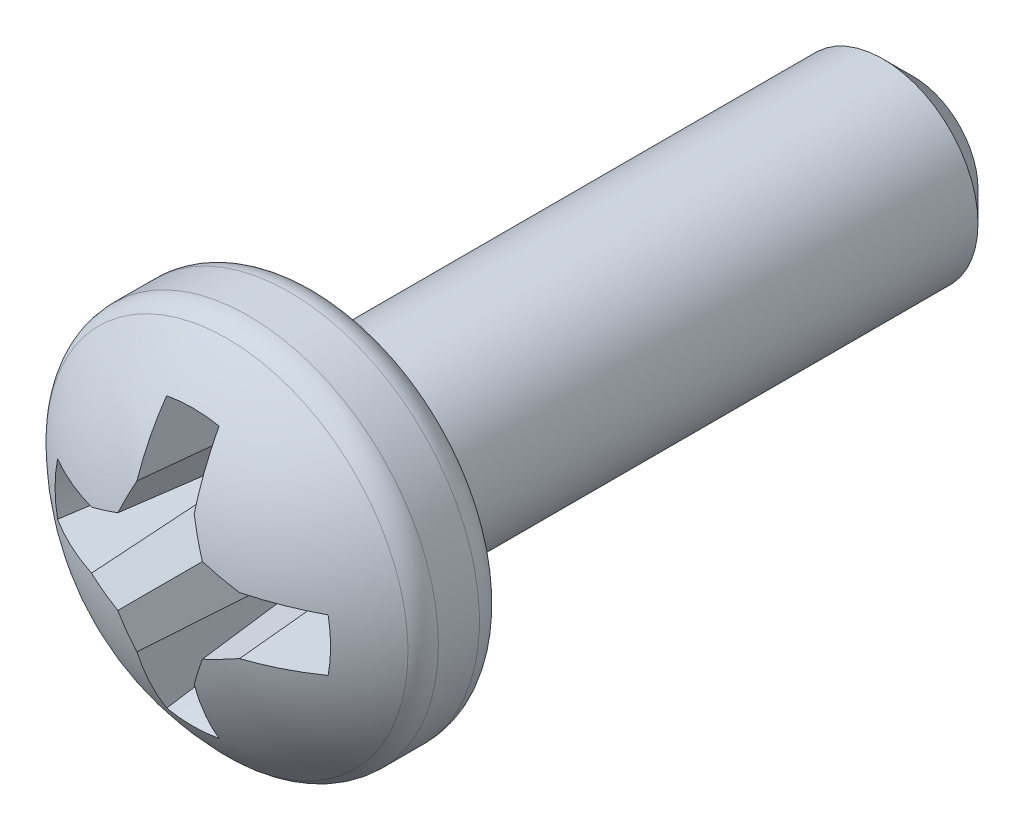
ISO-10303-21;
HEADER;
FILE_DESCRIPTION(('STEP AP214'),'2;1');
FILE_NAME('part.step','',(''),(''),'','','');
FILE_SCHEMA(('AUTOMOTIVE_DESIGN { 1 0 10303 214 1 1 1 1 }'));
ENDSEC;
DATA;
#1=APPLICATION_CONTEXT('core data for automotive mechanical design processes');
#2=APPLICATION_PROTOCOL_DEFINITION('international standard','automotive_design',2000,#1);
#3=PRODUCT_CONTEXT('',#1,'mechanical');
#4=PRODUCT('Part','Part','',(#3));
#5=PRODUCT_RELATED_PRODUCT_CATEGORY('part','',(#4));
#6=PRODUCT_DEFINITION_FORMATION('','',#4);
#7=PRODUCT_DEFINITION_CONTEXT('part definition',#1,'design');
#8=PRODUCT_DEFINITION('design','',#6,#7);
#9=PRODUCT_DEFINITION_SHAPE('','',#8);
#10=(LENGTH_UNIT() NAMED_UNIT(*) SI_UNIT(.MILLI.,.METRE.));
#11=(NAMED_UNIT(*) PLANE_ANGLE_UNIT() SI_UNIT($,.RADIAN.));
#12=(NAMED_UNIT(*) SI_UNIT($,.STERADIAN.) SOLID_ANGLE_UNIT());
#13=UNCERTAINTY_MEASURE_WITH_UNIT(LENGTH_MEASURE(1.E-05),#10,'distance_accuracy_value','');
#14=(GEOMETRIC_REPRESENTATION_CONTEXT(3) GLOBAL_UNCERTAINTY_ASSIGNED_CONTEXT((#13)) GLOBAL_UNIT_ASSIGNED_CONTEXT((#10,
#11,#12)) REPRESENTATION_CONTEXT('',''));
#15=CARTESIAN_POINT('',(0.,0.,0.));
#16=DIRECTION('',(0.,0.,1.));
#17=DIRECTION('',(1.,0.,0.));
#18=AXIS2_PLACEMENT_3D('',#15,#16,#17);
#19=CARTESIAN_POINT('',(0.905878325384203,0.791461441644268,0.413196607862429));
#20=DIRECTION('',(0.,0.,1.));
#21=DIRECTION('',(1.,0.,0.));
#22=AXIS2_PLACEMENT_3D('',#19,#20,#21);
#23=PLANE('',#22);
#24=DIRECTION('',(0.382683432365081,-0.92387953251129,0.));
#25=VECTOR('',#24,1.);
#26=CARTESIAN_POINT('',(0.919192212154071,0.796976234112247,0.413196607862429));
#27=LINE('',#26,#25);
#28=CARTESIAN_POINT('',(0.911621966738697,0.815252423264536,0.413196607862429));
#29=VERTEX_POINT('',#28);
#30=CARTESIAN_POINT('',(0.916907910320162,0.802491026580226,0.413196607862429));
#31=VERTEX_POINT('',#30);
#32=EDGE_CURVE('E292',#29,#31,#27,.T.);
#33=ORIENTED_EDGE('',*,*,#32,.F.);
#34=DIRECTION('',(0.,1.,0.));
#35=VECTOR('',#34,1.);
#36=CARTESIAN_POINT('',(0.911621966738698,0.791461441644268,0.413196607862429));
#37=LINE('',#36,#35);
#38=CARTESIAN_POINT('',(0.911621966738698,0.827667770299277,0.413196607862429));
#39=VERTEX_POINT('',#38);
#40=EDGE_CURVE('E168',#39,#29,#37,.F.);
#41=ORIENTED_EDGE('',*,*,#40,.F.);
#42=CARTESIAN_POINT('',(0.905878325384203,0.791461441644268,0.413196607862429));
#43=DIRECTION('',(0.,0.,1.));
#44=DIRECTION('',(1.,0.,0.));
#45=AXIS2_PLACEMENT_3D('',#42,#43,#44);
#46=CIRCLE('',#45,0.0366590732381981);
#47=CARTESIAN_POINT('',(0.900134684029712,0.827667770299278,0.413196607862429));
#48=VERTEX_POINT('',#47);
#49=EDGE_CURVE('E159',#39,#48,#46,.T.);
#50=ORIENTED_EDGE('',*,*,#49,.T.);
#51=DIRECTION('',(0.,1.,0.));
#52=VECTOR('',#51,1.);
#53=CARTESIAN_POINT('',(0.900134684029713,0.791461441644271,0.413196607862429));
#54=LINE('',#53,#52);
#55=CARTESIAN_POINT('',(0.900134684029712,0.815252423264539,0.413196607862429));
#56=VERTEX_POINT('',#55);
#57=EDGE_CURVE('E166',#56,#48,#54,.T.);
#58=ORIENTED_EDGE('',*,*,#57,.F.);
#59=DIRECTION('',(0.382683432365079,0.923879532511291,0.));
#60=VECTOR('',#59,1.);
#61=CARTESIAN_POINT('',(0.892564438614339,0.79697623411225,0.413196607862429));
#62=LINE('',#61,#60);
#63=CARTESIAN_POINT('',(0.894848740448248,0.802491026580229,0.413196607862429));
#64=VERTEX_POINT('',#63);
#65=EDGE_CURVE('E301',#64,#56,#62,.T.);
#66=ORIENTED_EDGE('',*,*,#65,.F.);
#67=DIRECTION('',(0.923879532511289,0.382683432365086,0.));
#68=VECTOR('',#67,1.);
#69=CARTESIAN_POINT('',(0.900363532916228,0.804775328414139,0.413196607862429));
#70=LINE('',#69,#68);
#71=CARTESIAN_POINT('',(0.882087343763938,0.797205082998765,0.413196607862429));
#72=VERTEX_POINT('',#71);
#73=EDGE_CURVE('E307',#72,#64,#70,.T.);
#74=ORIENTED_EDGE('',*,*,#73,.F.);
#75=DIRECTION('',(1.,0.,0.));
#76=VECTOR('',#75,1.);
#77=CARTESIAN_POINT('',(0.905878325384207,0.797205082998765,0.413196607862429));
#78=LINE('',#77,#76);
#79=CARTESIAN_POINT('',(0.869671996676527,0.797205082997996,0.413196607853642));
#80=VERTEX_POINT('',#79);
#81=EDGE_CURVE('E313',#80,#72,#78,.T.);
#82=ORIENTED_EDGE('',*,*,#81,.F.);
#83=CARTESIAN_POINT('',(0.905878325384206,0.791461441644271,0.413196607862429));
#84=DIRECTION('',(0.,0.,1.));
#85=DIRECTION('',(1.,0.,0.));
#86=AXIS2_PLACEMENT_3D('',#83,#84,#85);
#87=CIRCLE('',#86,0.0366590732924525);
#88=CARTESIAN_POINT('',(0.869671996674264,0.78571780028978,0.413196607862429));
#89=VERTEX_POINT('',#88);
#90=EDGE_CURVE('E410',#80,#89,#87,.T.);
#91=ORIENTED_EDGE('',*,*,#90,.T.);
#92=DIRECTION('',(1.,0.,0.));
#93=VECTOR('',#92,1.);
#94=CARTESIAN_POINT('',(0.905878325384203,0.78571780028978,0.413196607862429));
#95=LINE('',#94,#93);
#96=CARTESIAN_POINT('',(0.882087343763935,0.78571780028978,0.413196607862429));
#97=VERTEX_POINT('',#96);
#98=EDGE_CURVE('E247',#97,#89,#95,.F.);
#99=ORIENTED_EDGE('',*,*,#98,.F.);
#100=DIRECTION('',(-0.923879532511292,0.382683432365076,0.));
#101=VECTOR('',#100,1.);
#102=CARTESIAN_POINT('',(0.900363532916224,0.778147554874406,0.413196607862429));
#103=LINE('',#102,#101);
#104=CARTESIAN_POINT('',(0.894848740448245,0.780431856708315,0.413196607862429));
#105=VERTEX_POINT('',#104);
#106=EDGE_CURVE('E248',#105,#97,#103,.T.);
#107=ORIENTED_EDGE('',*,*,#106,.F.);
#108=DIRECTION('',(-0.38268343236509,0.923879532511287,0.));
#109=VECTOR('',#108,1.);
#110=CARTESIAN_POINT('',(0.892564438614334,0.785946649176296,0.413196607862429));
#111=LINE('',#110,#109);
#112=CARTESIAN_POINT('',(0.900134684029709,0.767670460024005,0.413196607862429));
#113=VERTEX_POINT('',#112);
#114=EDGE_CURVE('E254',#113,#105,#111,.T.);
#115=ORIENTED_EDGE('',*,*,#114,.F.);
#116=DIRECTION('',(0.,1.,0.));
#117=VECTOR('',#116,1.);
#118=CARTESIAN_POINT('',(0.900134684029709,0.791461441644275,0.413196607862429));
#119=LINE('',#118,#117);
#120=CARTESIAN_POINT('',(0.90013468402971,0.755255112947135,0.413196607862429));
#121=VERTEX_POINT('',#120);
#122=EDGE_CURVE('E260',#121,#113,#119,.T.);
#123=ORIENTED_EDGE('',*,*,#122,.F.);
#124=CARTESIAN_POINT('',(0.905878325384204,0.791461441644275,0.413196607862429));
#125=DIRECTION('',(0.,0.,1.));
#126=DIRECTION('',(1.,0.,0.));
#127=AXIS2_PLACEMENT_3D('',#124,#125,#126);
#128=CIRCLE('',#127,0.0366590732798089);
#129=CARTESIAN_POINT('',(0.911621966738695,0.755255112947134,0.413196607862429));
#130=VERTEX_POINT('',#129);
#131=EDGE_CURVE('E336',#121,#130,#128,.T.);
#132=ORIENTED_EDGE('',*,*,#131,.T.);
#133=DIRECTION('',(0.,1.,0.));
#134=VECTOR('',#133,1.);
#135=CARTESIAN_POINT('',(0.911621966738694,0.791461441644272,0.413196607862429));
#136=LINE('',#135,#134);
#137=CARTESIAN_POINT('',(0.911621966738695,0.767670460024002,0.413196607862429));
#138=VERTEX_POINT('',#137);
#139=EDGE_CURVE('E266',#138,#130,#136,.F.);
#140=ORIENTED_EDGE('',*,*,#139,.F.);
#141=DIRECTION('',(-0.382683432365075,-0.923879532511293,0.));
#142=VECTOR('',#141,1.);
#143=CARTESIAN_POINT('',(0.919192212154069,0.785946649176293,0.413196607862429));
#144=LINE('',#143,#142);
#145=CARTESIAN_POINT('',(0.916907910320159,0.780431856708313,0.413196607862429));
#146=VERTEX_POINT('',#145);
#147=EDGE_CURVE('E267',#146,#138,#144,.T.);
#148=ORIENTED_EDGE('',*,*,#147,.F.);
#149=DIRECTION('',(-0.923879532511286,-0.382683432365092,0.));
#150=VECTOR('',#149,1.);
#151=CARTESIAN_POINT('',(0.911393117852179,0.778147554874402,0.413196607862429));
#152=LINE('',#151,#150);
#153=CARTESIAN_POINT('',(0.929669307004469,0.785717800289777,0.413196607862429));
#154=VERTEX_POINT('',#153);
#155=EDGE_CURVE('E273',#154,#146,#152,.T.);
#156=ORIENTED_EDGE('',*,*,#155,.F.);
#157=DIRECTION('',(1.,0.,0.));
#158=VECTOR('',#157,1.);
#159=CARTESIAN_POINT('',(0.9058783253842,0.785717800289777,0.413196607862429));
#160=LINE('',#159,#158);
#161=CARTESIAN_POINT('',(0.942084654039212,0.785717800289777,0.413196607862429));
#162=VERTEX_POINT('',#161);
#163=EDGE_CURVE('E279',#162,#154,#160,.F.);
#164=ORIENTED_EDGE('',*,*,#163,.F.);
#165=CARTESIAN_POINT('',(0.905878325384203,0.791461441644268,0.413196607862429));
#166=DIRECTION('',(0.,0.,1.));
#167=DIRECTION('',(1.,0.,0.));
#168=AXIS2_PLACEMENT_3D('',#165,#166,#167);
#169=CIRCLE('',#168,0.0366590732381981);
#170=CARTESIAN_POINT('',(0.942084654039212,0.797205082998762,0.413196607862429));
#171=VERTEX_POINT('',#170);
#172=EDGE_CURVE('E492',#162,#171,#169,.T.);
#173=ORIENTED_EDGE('',*,*,#172,.T.);
#174=DIRECTION('',(1.,0.,0.));
#175=VECTOR('',#174,1.);
#176=CARTESIAN_POINT('',(0.905878325384203,0.797205082998762,0.413196607862429));
#177=LINE('',#176,#175);
#178=CARTESIAN_POINT('',(0.929669307004472,0.797205082998762,0.413196607862429));
#179=VERTEX_POINT('',#178);
#180=EDGE_CURVE('E285',#179,#171,#177,.T.);
#181=ORIENTED_EDGE('',*,*,#180,.F.);
#182=DIRECTION('',(0.92387953251129,-0.382683432365083,0.));
#183=VECTOR('',#182,1.);
#184=CARTESIAN_POINT('',(0.911393117852182,0.804775328414136,0.413196607862429));
#185=LINE('',#184,#183);
#186=EDGE_CURVE('E286',#31,#179,#185,.T.);
#187=ORIENTED_EDGE('',*,*,#186,.F.);
#188=EDGE_LOOP('',(#33,#41,#50,#58,#66,#74,#82,#91,#99,#107,#115,#123,#132,#140,#148,#156,#164,
#173,#181,#187));
#189=FACE_BOUND('',#188,.T.);
#190=ADVANCED_FACE('F17',(#189),#23,.T.);
#191=CARTESIAN_POINT('',(0.905878325384207,0.801303961329311,0.460047001563216));
#192=DIRECTION('',(0.,-0.996194698091744,0.0871557427476727));
#193=DIRECTION('',(0.,-0.0871557427476727,-0.996194698091744));
#194=AXIS2_PLACEMENT_3D('',#191,#192,#193);
#195=PLANE('',#194);
#196=DIRECTION('',(0.0173337504938649,-0.0871426484044457,-0.996045029063885));
#197=VECTOR('',#196,1.);
#198=CARTESIAN_POINT('',(0.881343943259578,0.8009424097128,0.455914447676356));
#199=LINE('',#198,#197);
#200=CARTESIAN_POINT('',(0.881343943259578,0.8009424097128,0.455914447676356));
#201=VERTEX_POINT('',#200);
#202=EDGE_CURVE('E310',#201,#72,#199,.T.);
#203=ORIENTED_EDGE('',*,*,#202,.F.);
#204=CARTESIAN_POINT('',(0.8610306923124,0.80015108887588,0.446869609122098));
#205=CARTESIAN_POINT('',(0.864219051995565,0.800321424804083,0.448816557690383));
#206=CARTESIAN_POINT('',(0.867506002749407,0.800472536171256,0.450543768520713));
#207=CARTESIAN_POINT('',(0.874277086398446,0.800736309783544,0.453558714705461));
#208=CARTESIAN_POINT('',(0.877761219293641,0.800848972028658,0.45484645005988));
#209=CARTESIAN_POINT('',(0.881343943259514,0.800942409712743,0.455914447676343));
#210=B_SPLINE_CURVE_WITH_KNOTS('',3,(#204,#205,#206,#207,#208,#209),.UNSPECIFIED.,.F.,.F.,(4,2,
4),(0.,0.0111485978671279,0.0222971957342559),.UNSPECIFIED.);
#211=CARTESIAN_POINT('',(0.861030692322977,0.800151088874494,0.446869609106245));
#212=VERTEX_POINT('',#211);
#213=EDGE_CURVE('E409',#212,#201,#210,.T.);
#214=ORIENTED_EDGE('',*,*,#213,.F.);
#215=CARTESIAN_POINT('',(0.861030692333555,0.800151088873107,0.446869609090391));
#216=CARTESIAN_POINT('',(0.862467160111317,0.79966000435443,0.441256487356838));
#217=CARTESIAN_POINT('',(0.863905502686871,0.799168961608414,0.435643843086986));
#218=CARTESIAN_POINT('',(0.866785937468525,0.798186959649785,0.424419509338453));
#219=CARTESIAN_POINT('',(0.868228029674715,0.797696000437175,0.418807819859794));
#220=CARTESIAN_POINT('',(0.869671996678788,0.797205082997228,0.41319660784486));
#221=B_SPLINE_CURVE_WITH_KNOTS('',3,(#215,#216,#217,#218,#219,#220),.UNSPECIFIED.,.F.,.F.,(4,2,
4),(0.,0.0174443558891329,0.0348887122017161),.UNSPECIFIED.);
#222=EDGE_CURVE('E318',#212,#80,#221,.T.);
#223=ORIENTED_EDGE('',*,*,#222,.T.);
#224=ORIENTED_EDGE('',*,*,#81,.T.);
#225=EDGE_LOOP('',(#203,#214,#223,#224));
#226=FACE_BOUND('',#225,.T.);
#227=ADVANCED_FACE('F427',(#226),#195,.T.);
#228=CARTESIAN_POINT('',(0.898794960087848,0.808562198209984,0.460047001563216));
#229=DIRECTION('',(0.381227206369649,-0.920363891963225,0.0871557427476661));
#230=DIRECTION('',(0.923879532511289,0.382683432365086,0.));
#231=AXIS2_PLACEMENT_3D('',#228,#229,#230);
#232=PLANE('',#231);
#233=DIRECTION('',(0.0666626913468223,-0.0666626913468416,-0.995546167269401));
#234=VECTOR('',#233,1.);
#235=CARTESIAN_POINT('',(0.891866961696687,0.805472805331791,0.457726739301586));
#236=LINE('',#235,#234);
#237=CARTESIAN_POINT('',(0.891866961696687,0.805472805331791,0.457726739301586));
#238=VERTEX_POINT('',#237);
#239=EDGE_CURVE('E304',#238,#64,#236,.T.);
#240=ORIENTED_EDGE('',*,*,#239,.F.);
#241=CARTESIAN_POINT('',(0.881343943259578,0.8009424097128,0.455914447676356));
#242=CARTESIAN_POINT('',(0.883074312814513,0.801700049456702,0.456346321822599));
#243=CARTESIAN_POINT('',(0.884816415795073,0.802456402296903,0.456713283197823));
#244=CARTESIAN_POINT('',(0.888324088607443,0.8039665341699,0.457317380406233));
#245=CARTESIAN_POINT('',(0.890089658439252,0.804720313202696,0.457554516239419));
#246=CARTESIAN_POINT('',(0.891866961696687,0.805472805331791,0.457726739301586));
#247=B_SPLINE_CURVE_WITH_KNOTS('',3,(#241,#242,#243,#244,#245,#246),.UNSPECIFIED.,.F.,.F.,(4,2,
4),(0.,0.00580300590917778,0.0116060118183555),.UNSPECIFIED.);
#248=EDGE_CURVE('E439',#201,#238,#247,.T.);
#249=ORIENTED_EDGE('',*,*,#248,.F.);
#250=ORIENTED_EDGE('',*,*,#202,.T.);
#251=ORIENTED_EDGE('',*,*,#73,.T.);
#252=EDGE_LOOP('',(#240,#249,#250,#251));
#253=FACE_BOUND('',#252,.T.);
#254=ADVANCED_FACE('F431',(#253),#232,.T.);
#255=CARTESIAN_POINT('',(0.888777568818494,0.79854480694063,0.460047001563216));
#256=DIRECTION('',(0.920363891963229,-0.381227206369643,0.0871557427476506));
#257=DIRECTION('',(0.382683432365079,0.923879532511291,0.));
#258=AXIS2_PLACEMENT_3D('',#255,#256,#257);
#259=PLANE('',#258);
#260=DIRECTION('',(0.0871426484044276,-0.0173337504938855,-0.996045029063886));
#261=VECTOR('',#260,1.);
#262=CARTESIAN_POINT('',(0.896397357315678,0.8159958237689,0.455914447676355));
#263=LINE('',#262,#261);
#264=CARTESIAN_POINT('',(0.896397357315678,0.8159958237689,0.455914447676355));
#265=VERTEX_POINT('',#264);
#266=EDGE_CURVE('E176',#265,#56,#263,.T.);
#267=ORIENTED_EDGE('',*,*,#266,.F.);
#268=CARTESIAN_POINT('',(0.891866961696687,0.805472805331791,0.457726739301586));
#269=CARTESIAN_POINT('',(0.892619453825782,0.807250108589226,0.457554516239419));
#270=CARTESIAN_POINT('',(0.893373232858578,0.809015678421036,0.457317380406232));
#271=CARTESIAN_POINT('',(0.894883364731575,0.812523351233405,0.456713283197822));
#272=CARTESIAN_POINT('',(0.895639717571776,0.814265454213965,0.456346321822598));
#273=CARTESIAN_POINT('',(0.896397357315678,0.8159958237689,0.455914447676355));
#274=B_SPLINE_CURVE_WITH_KNOTS('',3,(#268,#269,#270,#271,#272,#273),.UNSPECIFIED.,.F.,.F.,(4,2,
4),(0.,0.00580300590917794,0.0116060118183557),.UNSPECIFIED.);
#275=EDGE_CURVE('E445',#238,#265,#274,.T.);
#276=ORIENTED_EDGE('',*,*,#275,.F.);
#277=ORIENTED_EDGE('',*,*,#239,.T.);
#278=ORIENTED_EDGE('',*,*,#65,.T.);
#279=EDGE_LOOP('',(#267,#276,#277,#278));
#280=FACE_BOUND('',#279,.T.);
#281=ADVANCED_FACE('F436',(#280),#259,.T.);
#282=CARTESIAN_POINT('',(0.896035805699168,0.791461441644271,0.460047001563216));
#283=DIRECTION('',(0.996194698091747,0.,0.0871557427476441));
#284=DIRECTION('',(0.0871557427476441,0.,-0.996194698091747));
#285=AXIS2_PLACEMENT_3D('',#282,#283,#284);
#286=PLANE('',#285);
#287=CARTESIAN_POINT('',(0.900134684024578,0.827667770307454,0.413196607882604));
#288=CARTESIAN_POINT('',(0.89964376658642,0.829111737317022,0.418807819896342));
#289=CARTESIAN_POINT('',(0.899152807375053,0.830553829529188,0.424419509373635));
#290=CARTESIAN_POINT('',(0.898170805417816,0.833434264323754,0.4356438431191));
#291=CARTESIAN_POINT('',(0.897679762671949,0.834872606906246,0.44125648738725));
#292=CARTESIAN_POINT('',(0.897188678152875,0.836309074691427,0.446869609118931));
#293=B_SPLINE_CURVE_WITH_KNOTS('',3,(#287,#288,#289,#290,#291,#292),.UNSPECIFIED.,.F.,.F.,(4,2,
4),(0.,0.0174443563127622,0.034888712202075),.UNSPECIFIED.);
#294=CARTESIAN_POINT('',(0.897188678153411,0.836309074689857,0.446869609112801));
#295=VERTEX_POINT('',#294);
#296=EDGE_CURVE('E170',#48,#295,#293,.T.);
#297=ORIENTED_EDGE('',*,*,#296,.T.);
#298=CARTESIAN_POINT('',(0.896397357315678,0.8159958237689,0.455914447676355));
#299=CARTESIAN_POINT('',(0.89649079499973,0.81957854773242,0.454846450060603));
#300=CARTESIAN_POINT('',(0.896603457244777,0.82306268062541,0.453558714707171));
#301=CARTESIAN_POINT('',(0.89686723085686,0.82983376427033,0.450543768524948));
#302=CARTESIAN_POINT('',(0.897018342223897,0.83312071502226,0.448816557696157));
#303=CARTESIAN_POINT('',(0.897188678151929,0.836309074703659,0.446869609129687));
#304=B_SPLINE_CURVE_WITH_KNOTS('',3,(#298,#299,#300,#301,#302,#303),.UNSPECIFIED.,.F.,.F.,(4,2,
4),(0.,0.0111485978598911,0.0222971957197821),.UNSPECIFIED.);
#305=EDGE_CURVE('E450',#265,#295,#304,.T.);
#306=ORIENTED_EDGE('',*,*,#305,.F.);
#307=ORIENTED_EDGE('',*,*,#266,.T.);
#308=ORIENTED_EDGE('',*,*,#57,.T.);
#309=EDGE_LOOP('',(#297,#306,#307,#308));
#310=FACE_BOUND('',#309,.T.);
#311=ADVANCED_FACE('F173',(#310),#286,.T.);
#312=CARTESIAN_POINT('',(0.905878325384203,0.791461441644268,0.446869608992984));
#313=DIRECTION('',(0.,0.,1.));
#314=DIRECTION('',(1.,0.,0.));
#315=AXIS2_PLACEMENT_3D('',#312,#313,#314);
#316=CONICAL_SURFACE('',#315,0.0456817267170827,0.261799388331704);
#317=ORIENTED_EDGE('',*,*,#296,.F.);
#318=ORIENTED_EDGE('',*,*,#49,.F.);
#319=CARTESIAN_POINT('',(0.914567972616278,0.836309074693598,0.446869609127417));
#320=CARTESIAN_POINT('',(0.914076888097495,0.834872606908126,0.441256487392648));
#321=CARTESIAN_POINT('',(0.913585845351373,0.833434264324886,0.435643843121576));
#322=CARTESIAN_POINT('',(0.912603843392531,0.83055382952791,0.424419509370597));
#323=CARTESIAN_POINT('',(0.912112884179813,0.829111737314083,0.418807819890712));
#324=CARTESIAN_POINT('',(0.911621966739758,0.827667770302396,0.413196607874548));
#325=B_SPLINE_CURVE_WITH_KNOTS('',3,(#319,#320,#321,#322,#323,#324),.UNSPECIFIED.,.F.,.F.,(4,2,
4),(0.,0.017444355898394,0.0348887122202384),.UNSPECIFIED.);
#326=CARTESIAN_POINT('',(0.914567972616392,0.83630907469836,0.446869609128716));
#327=VERTEX_POINT('',#326);
#328=EDGE_CURVE('E182',#327,#39,#325,.T.);
#329=ORIENTED_EDGE('',*,*,#328,.F.);
#330=CARTESIAN_POINT('',(0.905878325384203,0.791461441644268,0.44686960910667));
#331=DIRECTION('',(0.,0.,1.));
#332=DIRECTION('',(1.,0.,0.));
#333=AXIS2_PLACEMENT_3D('',#330,#331,#332);
#334=CIRCLE('',#333,0.045681726747545);
#335=EDGE_CURVE('E180',#295,#327,#334,.F.);
#336=ORIENTED_EDGE('',*,*,#335,.F.);
#337=EDGE_LOOP('',(#317,#318,#329,#336));
#338=FACE_BOUND('',#337,.T.);
#339=ADVANCED_FACE('F178',(#338),#316,.F.);
#340=CARTESIAN_POINT('',(0.915720845069243,0.791461441644268,0.460047001563216));
#341=DIRECTION('',(-0.996194698091746,0.,0.0871557427476584));
#342=DIRECTION('',(0.0871557427476584,0.,0.996194698091746));
#343=AXIS2_PLACEMENT_3D('',#340,#341,#342);
#344=PLANE('',#343);
#345=DIRECTION('',(-0.0871426484044405,-0.0173337504938649,-0.996045029063885));
#346=VECTOR('',#345,1.);
#347=CARTESIAN_POINT('',(0.915359293452732,0.815995823768896,0.455914447676356));
#348=LINE('',#347,#346);
#349=CARTESIAN_POINT('',(0.915359293452732,0.815995823768896,0.455914447676356));
#350=VERTEX_POINT('',#349);
#351=EDGE_CURVE('E295',#350,#29,#348,.T.);
#352=ORIENTED_EDGE('',*,*,#351,.F.);
#353=CARTESIAN_POINT('',(0.914567972616506,0.836309074703123,0.446869609130015));
#354=CARTESIAN_POINT('',(0.914738308544532,0.833120715021802,0.448816557696406));
#355=CARTESIAN_POINT('',(0.914889419911565,0.829833764269957,0.450543768525129));
#356=CARTESIAN_POINT('',(0.915153193523642,0.823062680625219,0.453558714707241));
#357=CARTESIAN_POINT('',(0.915265855768687,0.819578547732327,0.45484645006063));
#358=CARTESIAN_POINT('',(0.915359293452738,0.81599582376891,0.45591444767635));
#359=B_SPLINE_CURVE_WITH_KNOTS('',3,(#353,#354,#355,#356,#357,#358),.UNSPECIFIED.,.F.,.F.,(4,2,
4),(0.,0.0111485978595717,0.0222971957191436),.UNSPECIFIED.);
#360=EDGE_CURVE('E210',#327,#350,#359,.T.);
#361=ORIENTED_EDGE('',*,*,#360,.F.);
#362=ORIENTED_EDGE('',*,*,#328,.T.);
#363=ORIENTED_EDGE('',*,*,#40,.T.);
#364=EDGE_LOOP('',(#352,#361,#362,#363));
#365=FACE_BOUND('',#364,.T.);
#366=ADVANCED_FACE('F199',(#365),#344,.T.);
#367=CARTESIAN_POINT('',(0.922979081949916,0.798544806940627,0.460047001563216));
#368=DIRECTION('',(-0.920363891963228,-0.381227206369645,0.0871557427476584));
#369=DIRECTION('',(0.382683432365081,-0.92387953251129,0.));
#370=AXIS2_PLACEMENT_3D('',#367,#368,#369);
#371=PLANE('',#370);
#372=DIRECTION('',(-0.0666626913468199,-0.0666626913468392,-0.995546167269401));
#373=VECTOR('',#372,1.);
#374=CARTESIAN_POINT('',(0.919889689071723,0.805472805331788,0.457726739301586));
#375=LINE('',#374,#373);
#376=CARTESIAN_POINT('',(0.919889689071723,0.805472805331788,0.457726739301586));
#377=VERTEX_POINT('',#376);
#378=EDGE_CURVE('E289',#377,#31,#375,.T.);
#379=ORIENTED_EDGE('',*,*,#378,.F.);
#380=CARTESIAN_POINT('',(0.915359293452732,0.815995823768896,0.455914447676356));
#381=CARTESIAN_POINT('',(0.916116933196635,0.814265454213961,0.456346321822598));
#382=CARTESIAN_POINT('',(0.916873286036835,0.812523351233401,0.456713283197823));
#383=CARTESIAN_POINT('',(0.918383417909832,0.809015678421032,0.457317380406233));
#384=CARTESIAN_POINT('',(0.919137196942628,0.807250108589223,0.457554516239419));
#385=CARTESIAN_POINT('',(0.919889689071723,0.805472805331788,0.457726739301586));
#386=B_SPLINE_CURVE_WITH_KNOTS('',3,(#380,#381,#382,#383,#384,#385),.UNSPECIFIED.,.F.,.F.,(4,2,
4),(0.,0.00580300590917684,0.0116060118183539),.UNSPECIFIED.);
#387=EDGE_CURVE('E218',#350,#377,#386,.T.);
#388=ORIENTED_EDGE('',*,*,#387,.F.);
#389=ORIENTED_EDGE('',*,*,#351,.T.);
#390=ORIENTED_EDGE('',*,*,#32,.T.);
#391=EDGE_LOOP('',(#379,#388,#389,#390));
#392=FACE_BOUND('',#391,.T.);
#393=ADVANCED_FACE('F204',(#392),#371,.T.);
#394=CARTESIAN_POINT('',(0.912961690680562,0.808562198209981,0.460047001563216));
#395=DIRECTION('',(-0.381227206369647,-0.920363891963227,0.0871557427476583));
#396=DIRECTION('',(0.92387953251129,-0.382683432365083,0.));
#397=AXIS2_PLACEMENT_3D('',#394,#395,#396);
#398=PLANE('',#397);
#399=DIRECTION('',(-0.0173337504938623,-0.0871426484044405,-0.996045029063885));
#400=VECTOR('',#399,1.);
#401=CARTESIAN_POINT('',(0.930412707508832,0.800942409712797,0.455914447676356));
#402=LINE('',#401,#400);
#403=CARTESIAN_POINT('',(0.930412707508832,0.800942409712797,0.455914447676356));
#404=VERTEX_POINT('',#403);
#405=EDGE_CURVE('E282',#404,#179,#402,.T.);
#406=ORIENTED_EDGE('',*,*,#405,.F.);
#407=CARTESIAN_POINT('',(0.919889689071723,0.805472805331788,0.457726739301586));
#408=CARTESIAN_POINT('',(0.921666992329158,0.804720313202693,0.457554516239419));
#409=CARTESIAN_POINT('',(0.923432562160967,0.803966534169897,0.457317380406233));
#410=CARTESIAN_POINT('',(0.926940234973337,0.8024564022969,0.456713283197822));
#411=CARTESIAN_POINT('',(0.928682337953897,0.801700049456699,0.456346321822598));
#412=CARTESIAN_POINT('',(0.930412707508832,0.800942409712797,0.455914447676355));
#413=B_SPLINE_CURVE_WITH_KNOTS('',3,(#407,#408,#409,#410,#411,#412),.UNSPECIFIED.,.F.,.F.,(4,2,
4),(0.,0.0058030059091779,0.0116060118183556),.UNSPECIFIED.);
#414=EDGE_CURVE('E462',#377,#404,#413,.T.);
#415=ORIENTED_EDGE('',*,*,#414,.F.);
#416=ORIENTED_EDGE('',*,*,#378,.T.);
#417=ORIENTED_EDGE('',*,*,#186,.T.);
#418=EDGE_LOOP('',(#406,#415,#416,#417));
#419=FACE_BOUND('',#418,.T.);
#420=ADVANCED_FACE('F474',(#419),#398,.T.);
#421=CARTESIAN_POINT('',(0.905878325384203,0.801303961329307,0.460047001563216));
#422=DIRECTION('',(0.,-0.996194698091746,0.0871557427476584));
#423=DIRECTION('',(0.,-0.0871557427476584,-0.996194698091746));
#424=AXIS2_PLACEMENT_3D('',#421,#422,#423);
#425=PLANE('',#424);
#426=CARTESIAN_POINT('',(0.942084654044387,0.797205083000521,0.413196607882534));
#427=CARTESIAN_POINT('',(0.943528621055366,0.797696000440336,0.418807819895954));
#428=CARTESIAN_POINT('',(0.944970713268487,0.798186959652813,0.424419509373094));
#429=CARTESIAN_POINT('',(0.947851148064053,0.799168961611175,0.435643843118583));
#430=CARTESIAN_POINT('',(0.94928949064659,0.799660004357057,0.441256487386909));
#431=CARTESIAN_POINT('',(0.950725958431361,0.8001510888756,0.446869609118931));
#432=B_SPLINE_CURVE_WITH_KNOTS('',3,(#426,#427,#428,#429,#430,#431),.UNSPECIFIED.,.F.,.F.,(4,2,
4),(0.,0.0174443563133109,0.0348887122031714),.UNSPECIFIED.);
#433=CARTESIAN_POINT('',(0.950725958429792,0.800151088875064,0.446869609112801));
#434=VERTEX_POINT('',#433);
#435=EDGE_CURVE('E351',#171,#434,#432,.T.);
#436=ORIENTED_EDGE('',*,*,#435,.T.);
#437=CARTESIAN_POINT('',(0.930412707508832,0.800942409712797,0.455914447676355));
#438=CARTESIAN_POINT('',(0.933995431472365,0.800848972028764,0.454846450060597));
#439=CARTESIAN_POINT('',(0.937479564365367,0.800736309783716,0.45355871470716));
#440=CARTESIAN_POINT('',(0.94425064801031,0.800472536171593,0.450543768524929));
#441=CARTESIAN_POINT('',(0.947537598762251,0.800321424804517,0.448816557696133));
#442=CARTESIAN_POINT('',(0.950725958443661,0.800151088876427,0.44686960912966));
#443=B_SPLINE_CURVE_WITH_KNOTS('',3,(#437,#438,#439,#440,#441,#442),.UNSPECIFIED.,.F.,.F.,(4,2,
4),(0.,0.0111485978599308,0.0222971957198614),.UNSPECIFIED.);
#444=EDGE_CURVE('E463',#404,#434,#443,.T.);
#445=ORIENTED_EDGE('',*,*,#444,.F.);
#446=ORIENTED_EDGE('',*,*,#405,.T.);
#447=ORIENTED_EDGE('',*,*,#180,.T.);
#448=EDGE_LOOP('',(#436,#445,#446,#447));
#449=FACE_BOUND('',#448,.T.);
#450=ADVANCED_FACE('F477',(#449),#425,.T.);
#451=CARTESIAN_POINT('',(0.905878325384203,0.791461441644268,0.446869608992984));
#452=DIRECTION('',(0.,0.,1.));
#453=DIRECTION('',(1.,0.,0.));
#454=AXIS2_PLACEMENT_3D('',#451,#452,#453);
#455=CONICAL_SURFACE('',#454,0.0456817267170827,0.261799388331704);
#456=ORIENTED_EDGE('',*,*,#172,.F.);
#457=CARTESIAN_POINT('',(0.950725958433534,0.782771794412197,0.446869609127417));
#458=CARTESIAN_POINT('',(0.949289490648017,0.783262878930996,0.441256487392472));
#459=CARTESIAN_POINT('',(0.947851148064732,0.783753921677133,0.435643843121224));
#460=CARTESIAN_POINT('',(0.944970713267665,0.784735923636006,0.424419509369892));
#461=CARTESIAN_POINT('',(0.943528621053792,0.785226882848739,0.418807819889831));
#462=CARTESIAN_POINT('',(0.94208465404206,0.785717800288809,0.413196607873491));
#463=B_SPLINE_CURVE_WITH_KNOTS('',3,(#457,#458,#459,#460,#461,#462),.UNSPECIFIED.,.F.,.F.,(4,2,
4),(0.,0.0174443558989415,0.0348887122213333),.UNSPECIFIED.);
#464=CARTESIAN_POINT('',(0.950725958438297,0.782771794412083,0.446869609128715));
#465=VERTEX_POINT('',#464);
#466=EDGE_CURVE('E346',#465,#162,#463,.T.);
#467=ORIENTED_EDGE('',*,*,#466,.F.);
#468=CARTESIAN_POINT('',(0.905878325384203,0.791461441644268,0.44686960910667));
#469=DIRECTION('',(0.,0.,1.));
#470=DIRECTION('',(1.,0.,0.));
#471=AXIS2_PLACEMENT_3D('',#468,#469,#470);
#472=CIRCLE('',#471,0.045681726747545);
#473=EDGE_CURVE('E464',#434,#465,#472,.F.);
#474=ORIENTED_EDGE('',*,*,#473,.F.);
#475=ORIENTED_EDGE('',*,*,#435,.F.);
#476=EDGE_LOOP('',(#456,#467,#474,#475));
#477=FACE_BOUND('',#476,.T.);
#478=ADVANCED_FACE('F482',(#477),#455,.F.);
#479=CARTESIAN_POINT('',(0.9058783253842,0.781618921959232,0.460047001563216));
#480=DIRECTION('',(0.,0.996194698091747,0.0871557427476441));
#481=DIRECTION('',(0.,-0.0871557427476441,0.996194698091747));
#482=AXIS2_PLACEMENT_3D('',#479,#480,#481);
#483=PLANE('',#482);
#484=DIRECTION('',(-0.0173337504938417,0.0871426484044261,-0.996045029063887));
#485=VECTOR('',#484,1.);
#486=CARTESIAN_POINT('',(0.930412707508828,0.781980473575742,0.455914447676357));
#487=LINE('',#486,#485);
#488=CARTESIAN_POINT('',(0.930412707508828,0.781980473575742,0.455914447676357));
#489=VERTEX_POINT('',#488);
#490=EDGE_CURVE('E276',#489,#154,#487,.T.);
#491=ORIENTED_EDGE('',*,*,#490,.F.);
#492=CARTESIAN_POINT('',(0.950725958443059,0.78277179441197,0.446869609130014));
#493=CARTESIAN_POINT('',(0.947537598761745,0.782601458483934,0.4488165576964));
#494=CARTESIAN_POINT('',(0.944250648009907,0.782450347116901,0.45054376852512));
#495=CARTESIAN_POINT('',(0.937479564365184,0.782186573504845,0.45355871470723));
#496=CARTESIAN_POINT('',(0.9339954314723,0.78207391125982,0.45484645006062));
#497=CARTESIAN_POINT('',(0.930412707508892,0.7819804735758,0.455914447676344));
#498=B_SPLINE_CURVE_WITH_KNOTS('',3,(#492,#493,#494,#495,#496,#497),.UNSPECIFIED.,.F.,.F.,(4,2,
4),(0.,0.0111485978595486,0.0222971957190972),.UNSPECIFIED.);
#499=EDGE_CURVE('E509',#465,#489,#498,.T.);
#500=ORIENTED_EDGE('',*,*,#499,.F.);
#501=ORIENTED_EDGE('',*,*,#466,.T.);
#502=ORIENTED_EDGE('',*,*,#163,.T.);
#503=EDGE_LOOP('',(#491,#500,#501,#502));
#504=FACE_BOUND('',#503,.T.);
#505=ADVANCED_FACE('F499',(#504),#483,.T.);
#506=CARTESIAN_POINT('',(0.912961690680559,0.774360685078558,0.460047001563216));
#507=DIRECTION('',(-0.381227206369656,0.920363891963225,0.0871557427476397));
#508=DIRECTION('',(-0.923879532511286,-0.382683432365092,0.));
#509=AXIS2_PLACEMENT_3D('',#506,#507,#508);
#510=PLANE('',#509);
#511=DIRECTION('',(-0.066662691346817,0.0666626913468194,-0.995546167269403));
#512=VECTOR('',#511,1.);
#513=CARTESIAN_POINT('',(0.91988968907172,0.777450077956752,0.457726739301588));
#514=LINE('',#513,#512);
#515=CARTESIAN_POINT('',(0.91988968907172,0.777450077956752,0.457726739301588));
#516=VERTEX_POINT('',#515);
#517=EDGE_CURVE('E270',#516,#146,#514,.T.);
#518=ORIENTED_EDGE('',*,*,#517,.F.);
#519=CARTESIAN_POINT('',(0.930412707508828,0.781980473575742,0.455914447676357));
#520=CARTESIAN_POINT('',(0.928682337953894,0.781222833831839,0.4563463218226));
#521=CARTESIAN_POINT('',(0.926940234973334,0.780466480991639,0.456713283197824));
#522=CARTESIAN_POINT('',(0.923432562160964,0.778956349118642,0.457317380406234));
#523=CARTESIAN_POINT('',(0.921666992329155,0.778202570085846,0.45755451623942));
#524=CARTESIAN_POINT('',(0.91988968907172,0.777450077956751,0.457726739301587));
#525=B_SPLINE_CURVE_WITH_KNOTS('',3,(#519,#520,#521,#522,#523,#524),.UNSPECIFIED.,.F.,.F.,(4,2,
4),(0.,0.00580300590917722,0.0116060118183545),.UNSPECIFIED.);
#526=EDGE_CURVE('E515',#489,#516,#525,.T.);
#527=ORIENTED_EDGE('',*,*,#526,.F.);
#528=ORIENTED_EDGE('',*,*,#490,.T.);
#529=ORIENTED_EDGE('',*,*,#155,.T.);
#530=EDGE_LOOP('',(#518,#527,#528,#529));
#531=FACE_BOUND('',#530,.T.);
#532=ADVANCED_FACE('F503',(#531),#510,.T.);
#533=CARTESIAN_POINT('',(0.922979081949913,0.784378076347913,0.460047001563216));
#534=DIRECTION('',(-0.920363891963232,0.381227206369639,0.0871557427476397));
#535=DIRECTION('',(-0.382683432365075,-0.923879532511293,0.));
#536=AXIS2_PLACEMENT_3D('',#533,#534,#535);
#537=PLANE('',#536);
#538=DIRECTION('',(-0.0871426484044258,0.0173337504938366,-0.996045029063887));
#539=VECTOR('',#538,1.);
#540=CARTESIAN_POINT('',(0.915359293452729,0.766927059519643,0.455914447676357));
#541=LINE('',#540,#539);
#542=CARTESIAN_POINT('',(0.915359293452729,0.766927059519643,0.455914447676357));
#543=VERTEX_POINT('',#542);
#544=EDGE_CURVE('E263',#543,#138,#541,.T.);
#545=ORIENTED_EDGE('',*,*,#544,.F.);
#546=CARTESIAN_POINT('',(0.91988968907172,0.777450077956752,0.457726739301587));
#547=CARTESIAN_POINT('',(0.919137196942626,0.775672774699317,0.45755451623942));
#548=CARTESIAN_POINT('',(0.918383417909829,0.773907204867507,0.457317380406234));
#549=CARTESIAN_POINT('',(0.916873286036832,0.770399532055138,0.456713283197824));
#550=CARTESIAN_POINT('',(0.916116933196632,0.768657429074578,0.4563463218226));
#551=CARTESIAN_POINT('',(0.915359293452729,0.766927059519643,0.455914447676357));
#552=B_SPLINE_CURVE_WITH_KNOTS('',3,(#546,#547,#548,#549,#550,#551),.UNSPECIFIED.,.F.,.F.,(4,2,
4),(0.,0.00580300590917774,0.0116060118183553),.UNSPECIFIED.);
#553=EDGE_CURVE('E535',#516,#543,#552,.T.);
#554=ORIENTED_EDGE('',*,*,#553,.F.);
#555=ORIENTED_EDGE('',*,*,#517,.T.);
#556=ORIENTED_EDGE('',*,*,#147,.T.);
#557=EDGE_LOOP('',(#545,#554,#555,#556));
#558=FACE_BOUND('',#557,.T.);
#559=ADVANCED_FACE('F548',(#558),#537,.T.);
#560=CARTESIAN_POINT('',(0.915720845069239,0.791461441644272,0.460047001563216));
#561=DIRECTION('',(-0.996194698091747,0.,0.0871557427476441));
#562=DIRECTION('',(0.0871557427476441,0.,0.996194698091747));
#563=AXIS2_PLACEMENT_3D('',#560,#561,#562);
#564=PLANE('',#563);
#565=CARTESIAN_POINT('',(0.911621966737307,0.755255112951218,0.413196607846562));
#566=CARTESIAN_POINT('',(0.912112884177994,0.753811145937962,0.418807819869951));
#567=CARTESIAN_POINT('',(0.912603843391343,0.752369053722573,0.424419509357063));
#568=CARTESIAN_POINT('',(0.91358584535145,0.749488618922491,0.435643843122501));
#569=CARTESIAN_POINT('',(0.914076888098205,0.748050276337706,0.441256487400804));
#570=CARTESIAN_POINT('',(0.914567972617621,0.746613808550698,0.446869609142806));
#571=B_SPLINE_CURVE_WITH_KNOTS('',3,(#565,#566,#567,#568,#569,#570),.UNSPECIFIED.,.F.,.F.,(4,2,
4),(0.,0.0174443563440907,0.0348887122647311),.UNSPECIFIED.);
#572=CARTESIAN_POINT('',(0.914567972618528,0.746613808548047,0.446869609153163));
#573=VERTEX_POINT('',#572);
#574=EDGE_CURVE('E559',#130,#573,#571,.T.);
#575=ORIENTED_EDGE('',*,*,#574,.T.);
#576=CARTESIAN_POINT('',(0.915359293452729,0.766927059519643,0.455914447676357));
#577=CARTESIAN_POINT('',(0.915265855768643,0.763344335554802,0.454846450060209));
#578=CARTESIAN_POINT('',(0.915153193523548,0.759860202660573,0.453558714706226));
#579=CARTESIAN_POINT('',(0.914889419911341,0.753089119013341,0.45054376852259));
#580=CARTESIAN_POINT('',(0.914738308544228,0.749802168260337,0.448816557692937));
#581=CARTESIAN_POINT('',(0.914567972616108,0.746613808577946,0.446869609125449));
#582=B_SPLINE_CURVE_WITH_KNOTS('',3,(#576,#577,#578,#579,#580,#581),.UNSPECIFIED.,.F.,.F.,(4,2,
4),(0.,0.0111485978639522,0.0222971957279045),.UNSPECIFIED.);
#583=EDGE_CURVE('E536',#543,#573,#582,.T.);
#584=ORIENTED_EDGE('',*,*,#583,.F.);
#585=ORIENTED_EDGE('',*,*,#544,.T.);
#586=ORIENTED_EDGE('',*,*,#139,.T.);
#587=EDGE_LOOP('',(#575,#584,#585,#586));
#588=FACE_BOUND('',#587,.T.);
#589=ADVANCED_FACE('F551',(#588),#564,.T.);
#590=CARTESIAN_POINT('',(0.905878325384204,0.791461441644275,0.446869609163513));
#591=DIRECTION('',(0.,0.,1.));
#592=DIRECTION('',(0.,-1.,0.));
#593=AXIS2_PLACEMENT_3D('',#590,#591,#592);
#594=CONICAL_SURFACE('',#593,0.0456817268023466,0.261799388275177);
#595=ORIENTED_EDGE('',*,*,#131,.F.);
#596=CARTESIAN_POINT('',(0.897188678160319,0.746613808560943,0.446869609131352));
#597=CARTESIAN_POINT('',(0.897679762675246,0.74805027634365,0.441256487391884));
#598=CARTESIAN_POINT('',(0.898170805418899,0.749488618925245,0.435643843116521));
#599=CARTESIAN_POINT('',(0.899152807375576,0.752369053721173,0.424419509357776));
#600=CARTESIAN_POINT('',(0.899643766588598,0.753811145935596,0.418807819874417));
#601=CARTESIAN_POINT('',(0.900134684030343,0.755255112948999,0.413196607855187));
#602=B_SPLINE_CURVE_WITH_KNOTS('',3,(#596,#597,#598,#599,#600,#601),.UNSPECIFIED.,.F.,.F.,(4,2,
4),(0.,0.0174443559089746,0.0348887122413974),.UNSPECIFIED.);
#603=CARTESIAN_POINT('',(0.897188678152146,0.746613808566178,0.446869609127228));
#604=VERTEX_POINT('',#603);
#605=EDGE_CURVE('E331',#604,#121,#602,.T.);
#606=ORIENTED_EDGE('',*,*,#605,.F.);
#607=CARTESIAN_POINT('',(0.905878325384204,0.791461441644275,0.446869609163513));
#608=DIRECTION('',(0.,0.,1.));
#609=DIRECTION('',(0.,-1.,0.));
#610=AXIS2_PLACEMENT_3D('',#607,#608,#609);
#611=CIRCLE('',#610,0.0456817268023466);
#612=EDGE_CURVE('E538',#573,#604,#611,.F.);
#613=ORIENTED_EDGE('',*,*,#612,.F.);
#614=ORIENTED_EDGE('',*,*,#574,.F.);
#615=EDGE_LOOP('',(#595,#606,#613,#614));
#616=FACE_BOUND('',#615,.T.);
#617=ADVANCED_FACE('F555',(#616),#594,.F.);
#618=CARTESIAN_POINT('',(0.896035805699164,0.791461441644275,0.460047001563216));
#619=DIRECTION('',(0.996194698091746,0.,0.0871557427476584));
#620=DIRECTION('',(0.0871557427476584,0.,-0.996194698091746));
#621=AXIS2_PLACEMENT_3D('',#618,#619,#620);
#622=PLANE('',#621);
#623=DIRECTION('',(0.0871426484044389,0.0173337504938312,-0.996045029063886));
#624=VECTOR('',#623,1.);
#625=CARTESIAN_POINT('',(0.896397357315674,0.766927059519646,0.455914447676358));
#626=LINE('',#625,#624);
#627=CARTESIAN_POINT('',(0.896397357315674,0.766927059519646,0.455914447676358));
#628=VERTEX_POINT('',#627);
#629=EDGE_CURVE('E257',#628,#113,#626,.T.);
#630=ORIENTED_EDGE('',*,*,#629,.F.);
#631=CARTESIAN_POINT('',(0.897188678152293,0.746613808578101,0.446869609125544));
#632=CARTESIAN_POINT('',(0.897018342224173,0.749802168260468,0.448816557693008));
#633=CARTESIAN_POINT('',(0.89686723085706,0.753089119013446,0.450543768522641));
#634=CARTESIAN_POINT('',(0.896603457244853,0.759860202660623,0.453558714706244));
#635=CARTESIAN_POINT('',(0.896490794999757,0.763344335554822,0.454846450060214));
#636=CARTESIAN_POINT('',(0.896397357315669,0.766927059519631,0.455914447676352));
#637=B_SPLINE_CURVE_WITH_KNOTS('',3,(#631,#632,#633,#634,#635,#636),.UNSPECIFIED.,.F.,.F.,(4,2,
4),(0.,0.0111485978638554,0.0222971957277107),.UNSPECIFIED.);
#638=EDGE_CURVE('E574',#604,#628,#637,.T.);
#639=ORIENTED_EDGE('',*,*,#638,.F.);
#640=ORIENTED_EDGE('',*,*,#605,.T.);
#641=ORIENTED_EDGE('',*,*,#122,.T.);
#642=EDGE_LOOP('',(#630,#639,#640,#641));
#643=FACE_BOUND('',#642,.T.);
#644=ADVANCED_FACE('F582',(#643),#622,.T.);
#645=CARTESIAN_POINT('',(0.88877756881849,0.784378076347916,0.460047001563216));
#646=DIRECTION('',(0.920363891963225,0.381227206369654,0.0871557427476474));
#647=DIRECTION('',(-0.38268343236509,0.923879532511287,0.));
#648=AXIS2_PLACEMENT_3D('',#645,#646,#647);
#649=PLANE('',#648);
#650=DIRECTION('',(0.0666626913468243,0.0666626913468074,-0.995546167269403));
#651=VECTOR('',#650,1.);
#652=CARTESIAN_POINT('',(0.891866961696684,0.777450077956755,0.457726739301588));
#653=LINE('',#652,#651);
#654=CARTESIAN_POINT('',(0.891866961696684,0.777450077956755,0.457726739301588));
#655=VERTEX_POINT('',#654);
#656=EDGE_CURVE('E251',#655,#105,#653,.T.);
#657=ORIENTED_EDGE('',*,*,#656,.F.);
#658=CARTESIAN_POINT('',(0.896397357315674,0.766927059519646,0.455914447676357));
#659=CARTESIAN_POINT('',(0.895639717571772,0.768657429074581,0.4563463218226));
#660=CARTESIAN_POINT('',(0.894883364731571,0.770399532055141,0.456713283197824));
#661=CARTESIAN_POINT('',(0.893373232858574,0.77390720486751,0.457317380406234));
#662=CARTESIAN_POINT('',(0.892619453825778,0.77567277469932,0.45755451623942));
#663=CARTESIAN_POINT('',(0.891866961696683,0.777450077956755,0.457726739301587));
#664=B_SPLINE_CURVE_WITH_KNOTS('',3,(#658,#659,#660,#661,#662,#663),.UNSPECIFIED.,.F.,.F.,(4,2,
4),(0.,0.00580300590917747,0.0116060118183551),.UNSPECIFIED.);
#665=EDGE_CURVE('E575',#628,#655,#664,.T.);
#666=ORIENTED_EDGE('',*,*,#665,.F.);
#667=ORIENTED_EDGE('',*,*,#629,.T.);
#668=ORIENTED_EDGE('',*,*,#114,.T.);
#669=EDGE_LOOP('',(#657,#666,#667,#668));
#670=FACE_BOUND('',#669,.T.);
#671=ADVANCED_FACE('F585',(#670),#649,.T.);
#672=CARTESIAN_POINT('',(0.898794960087845,0.774360685078562,0.460047001563217));
#673=DIRECTION('',(0.381227206369641,0.920363891963232,0.0871557427476319));
#674=DIRECTION('',(-0.923879532511292,0.382683432365076,0.));
#675=AXIS2_PLACEMENT_3D('',#672,#673,#674);
#676=PLANE('',#675);
#677=DIRECTION('',(0.0173337504938645,0.0871426484044134,-0.996045029063888));
#678=VECTOR('',#677,1.);
#679=CARTESIAN_POINT('',(0.881343943259575,0.781980473575746,0.455914447676357));
#680=LINE('',#679,#678);
#681=CARTESIAN_POINT('',(0.881343943259575,0.781980473575746,0.455914447676357));
#682=VERTEX_POINT('',#681);
#683=EDGE_CURVE('E244',#682,#97,#680,.T.);
#684=ORIENTED_EDGE('',*,*,#683,.F.);
#685=CARTESIAN_POINT('',(0.891866961696684,0.777450077956755,0.457726739301587));
#686=CARTESIAN_POINT('',(0.890089658439249,0.77820257008585,0.45755451623942));
#687=CARTESIAN_POINT('',(0.888324088607439,0.778956349118646,0.457317380406234));
#688=CARTESIAN_POINT('',(0.88481641579507,0.780466480991643,0.456713283197823));
#689=CARTESIAN_POINT('',(0.88307431281451,0.781222833831843,0.456346321822599));
#690=CARTESIAN_POINT('',(0.881343943259575,0.781980473575746,0.455914447676356));
#691=B_SPLINE_CURVE_WITH_KNOTS('',3,(#685,#686,#687,#688,#689,#690),.UNSPECIFIED.,.F.,.F.,(4,2,
4),(0.,0.00580300590917764,0.0116060118183553),.UNSPECIFIED.);
#692=EDGE_CURVE('E388',#655,#682,#691,.T.);
#693=ORIENTED_EDGE('',*,*,#692,.F.);
#694=ORIENTED_EDGE('',*,*,#656,.T.);
#695=ORIENTED_EDGE('',*,*,#106,.T.);
#696=EDGE_LOOP('',(#684,#693,#694,#695));
#697=FACE_BOUND('',#696,.T.);
#698=ADVANCED_FACE('F397',(#697),#676,.T.);
#699=CARTESIAN_POINT('',(0.905878325384203,0.781618921959236,0.460047001563216));
#700=DIRECTION('',(0.,0.996194698091748,0.0871557427476297));
#701=DIRECTION('',(0.,-0.0871557427476297,0.996194698091748));
#702=AXIS2_PLACEMENT_3D('',#699,#700,#701);
#703=PLANE('',#702);
#704=CARTESIAN_POINT('',(0.869671996681595,0.785717800294765,0.413196607846229));
#705=CARTESIAN_POINT('',(0.86822802967609,0.785226882853084,0.418807819860586));
#706=CARTESIAN_POINT('',(0.86678593746895,0.78473592363932,0.424419509338842));
#707=CARTESIAN_POINT('',(0.863905502686361,0.783753921679543,0.43564384308692));
#708=CARTESIAN_POINT('',(0.862467160110821,0.783262878933532,0.441256487356718));
#709=CARTESIAN_POINT('',(0.861030692333554,0.782771794415439,0.446869609090392));
#710=B_SPLINE_CURVE_WITH_KNOTS('',3,(#704,#705,#706,#707,#708,#709),.UNSPECIFIED.,.F.,.F.,(4,2,
4),(0.,0.0174443563124173,0.0348887122013832),.UNSPECIFIED.);
#711=CARTESIAN_POINT('',(0.861030692338746,0.782771794417214,0.446869609070109));
#712=VERTEX_POINT('',#711);
#713=EDGE_CURVE('E403',#89,#712,#710,.T.);
#714=ORIENTED_EDGE('',*,*,#713,.T.);
#715=CARTESIAN_POINT('',(0.881343943259575,0.781980473575746,0.455914447676356));
#716=CARTESIAN_POINT('',(0.877761219293681,0.782073911259841,0.454846450059891));
#717=CARTESIAN_POINT('',(0.874277086398465,0.782186573504974,0.453558714705468));
#718=CARTESIAN_POINT('',(0.867506002749389,0.782450347117318,0.450543768520709));
#719=CARTESIAN_POINT('',(0.864219051995528,0.782601458484529,0.448816557690372));
#720=CARTESIAN_POINT('',(0.861030692312346,0.782771794412779,0.446869609122079));
#721=B_SPLINE_CURVE_WITH_KNOTS('',3,(#715,#716,#717,#718,#719,#720),.UNSPECIFIED.,.F.,.F.,(4,2,
4),(0.,0.0111485978671901,0.0222971957343804),.UNSPECIFIED.);
#722=EDGE_CURVE('E382',#682,#712,#721,.T.);
#723=ORIENTED_EDGE('',*,*,#722,.F.);
#724=ORIENTED_EDGE('',*,*,#683,.T.);
#725=ORIENTED_EDGE('',*,*,#98,.T.);
#726=EDGE_LOOP('',(#714,#723,#724,#725));
#727=FACE_BOUND('',#726,.T.);
#728=ADVANCED_FACE('F394',(#727),#703,.T.);
#729=CARTESIAN_POINT('',(0.905878325384207,0.791461441644271,0.446869608879295));
#730=DIRECTION('',(0.,0.,1.));
#731=DIRECTION('',(0.,-1.,0.));
#732=AXIS2_PLACEMENT_3D('',#729,#730,#731);
#733=CONICAL_SURFACE('',#732,0.0456817266972227,0.261799387122199);
#734=ORIENTED_EDGE('',*,*,#90,.F.);
#735=ORIENTED_EDGE('',*,*,#222,.F.);
#736=CARTESIAN_POINT('',(0.905878325384207,0.791461441644271,0.446869609049826));
#737=DIRECTION('',(0.,0.,1.));
#738=DIRECTION('',(0.,-1.,0.));
#739=AXIS2_PLACEMENT_3D('',#736,#737,#738);
#740=CIRCLE('',#739,0.0456817267429161);
#741=EDGE_CURVE('E380',#712,#212,#740,.F.);
#742=ORIENTED_EDGE('',*,*,#741,.F.);
#743=ORIENTED_EDGE('',*,*,#713,.F.);
#744=EDGE_LOOP('',(#734,#735,#742,#743));
#745=FACE_BOUND('',#744,.T.);
#746=ADVANCED_FACE('F231',(#745),#733,.F.);
#747=CARTESIAN_POINT('',(0.905878325384203,0.791461441644268,0.374276472879301));
#748=DIRECTION('',(1.,0.,0.));
#749=DIRECTION('',(0.,1.,0.));
#750=AXIS2_PLACEMENT_3D('',#747,#748,#749);
#751=SPHERICAL_SURFACE('',#750,0.0857705286839147);
#752=ORIENTED_EDGE('',*,*,#444,.T.);
#753=ORIENTED_EDGE('',*,*,#473,.T.);
#754=ORIENTED_EDGE('',*,*,#499,.T.);
#755=ORIENTED_EDGE('',*,*,#526,.T.);
#756=ORIENTED_EDGE('',*,*,#553,.T.);
#757=ORIENTED_EDGE('',*,*,#583,.T.);
#758=ORIENTED_EDGE('',*,*,#612,.T.);
#759=ORIENTED_EDGE('',*,*,#638,.T.);
#760=ORIENTED_EDGE('',*,*,#665,.T.);
#761=ORIENTED_EDGE('',*,*,#692,.T.);
#762=ORIENTED_EDGE('',*,*,#722,.T.);
#763=ORIENTED_EDGE('',*,*,#741,.T.);
#764=ORIENTED_EDGE('',*,*,#213,.T.);
#765=ORIENTED_EDGE('',*,*,#248,.T.);
#766=ORIENTED_EDGE('',*,*,#275,.T.);
#767=ORIENTED_EDGE('',*,*,#305,.T.);
#768=ORIENTED_EDGE('',*,*,#335,.T.);
#769=ORIENTED_EDGE('',*,*,#360,.T.);
#770=ORIENTED_EDGE('',*,*,#387,.T.);
#771=ORIENTED_EDGE('',*,*,#414,.T.);
#772=EDGE_LOOP('',(#752,#753,#754,#755,#756,#757,#758,#759,#760,#761,#762,#763,#764,#765,#766,
#767,#768,#769,#770,#771));
#773=FACE_BOUND('',#772,.T.);
#774=CARTESIAN_POINT('',(0.905878325384203,0.791461441644267,0.435555053516584));
#775=DIRECTION('',(0.,0.,-1.));
#776=DIRECTION('',(0.,1.,0.));
#777=AXIS2_PLACEMENT_3D('',#774,#775,#776);
#778=CIRCLE('',#777,0.0600126582130671);
#779=CARTESIAN_POINT('',(0.905878325384203,0.851474099857334,0.435555053516583));
#780=VERTEX_POINT('',#779);
#781=EDGE_CURVE('E376',#780,#780,#778,.T.);
#782=ORIENTED_EDGE('',*,*,#781,.F.);
#783=EDGE_LOOP('',(#782));
#784=FACE_BOUND('',#783,.T.);
#785=ADVANCED_FACE('F224',(#773,#784),#751,.T.);
#786=CARTESIAN_POINT('',(0.905878325384203,0.791461441644267,0.428466829500573));
#787=DIRECTION('',(0.,0.,-1.));
#788=DIRECTION('',(0.,1.,0.));
#789=AXIS2_PLACEMENT_3D('',#786,#787,#788);
#790=TOROIDAL_SURFACE('',#789,0.0530708661417328,0.00992125984251978);
#791=ORIENTED_EDGE('',*,*,#781,.T.);
#792=EDGE_LOOP('',(#791));
#793=FACE_BOUND('',#792,.T.);
#794=CARTESIAN_POINT('',(0.905878325384203,0.791461441644268,0.428466829500572));
#795=DIRECTION('',(0.,0.,1.));
#796=DIRECTION('',(1.,0.,0.));
#797=AXIS2_PLACEMENT_3D('',#794,#795,#796);
#798=CIRCLE('',#797,0.0629921259842517);
#799=CARTESIAN_POINT('',(0.968870451368455,0.791461441644268,0.428466829500572));
#800=VERTEX_POINT('',#799);
#801=EDGE_CURVE('E379',#800,#800,#798,.F.);
#802=ORIENTED_EDGE('',*,*,#801,.F.);
#803=EDGE_LOOP('',(#802));
#804=FACE_BOUND('',#803,.T.);
#805=ADVANCED_FACE('F230',(#793,#804),#790,.T.);
#806=CARTESIAN_POINT('',(0.905878325384203,0.791461441644268,0.208078497626208));
#807=DIRECTION('',(0.,0.,1.));
#808=DIRECTION('',(1.,0.,0.));
#809=AXIS2_PLACEMENT_3D('',#806,#807,#808);
#810=CYLINDRICAL_SURFACE('',#809,0.0629921259842517);
#811=ORIENTED_EDGE('',*,*,#801,.T.);
#812=EDGE_LOOP('',(#811));
#813=FACE_BOUND('',#812,.T.);
#814=CARTESIAN_POINT('',(0.905878325384203,0.791461441644267,0.414850151169516));
#815=DIRECTION('',(0.,0.,-1.));
#816=DIRECTION('',(0.,1.,0.));
#817=AXIS2_PLACEMENT_3D('',#814,#815,#816);
#818=CIRCLE('',#817,0.0629921259842528);
#819=CARTESIAN_POINT('',(0.905878325384203,0.85445356762852,0.414850151169515));
#820=VERTEX_POINT('',#819);
#821=EDGE_CURVE('E639',#820,#820,#818,.T.);
#822=ORIENTED_EDGE('',*,*,#821,.F.);
#823=EDGE_LOOP('',(#822));
#824=FACE_BOUND('',#823,.T.);
#825=ADVANCED_FACE('F634',(#813,#824),#810,.T.);
#826=CARTESIAN_POINT('',(0.905878325384203,0.791461441644267,0.414850151169516));
#827=DIRECTION('',(0.,0.,-1.));
#828=DIRECTION('',(0.,1.,0.));
#829=AXIS2_PLACEMENT_3D('',#826,#827,#828);
#830=TOROIDAL_SURFACE('',#829,0.053070866141733,0.00992125984251974);
#831=CARTESIAN_POINT('',(0.905878325384203,0.791461441644267,0.404928891326996));
#832=DIRECTION('',(0.,0.,1.));
#833=DIRECTION('',(0.,-1.,0.));
#834=AXIS2_PLACEMENT_3D('',#831,#832,#833);
#835=CIRCLE('',#834,0.0530708661417329);
#836=CARTESIAN_POINT('',(0.905878325384203,0.844532307786,0.404928891326996));
#837=VERTEX_POINT('',#836);
#838=CARTESIAN_POINT('',(0.905878325384203,0.738390575502534,0.404928891326997));
#839=VERTEX_POINT('',#838);
#840=EDGE_CURVE('E646',#837,#839,#835,.F.);
#841=ORIENTED_EDGE('',*,*,#840,.F.);
#842=CARTESIAN_POINT('',(0.905878325384203,0.791461441644267,0.404928891326996));
#843=DIRECTION('',(0.,0.,1.));
#844=DIRECTION('',(0.,1.,0.));
#845=AXIS2_PLACEMENT_3D('',#842,#843,#844);
#846=CIRCLE('',#845,0.053070866141733);
#847=EDGE_CURVE('E36',#839,#837,#846,.F.);
#848=ORIENTED_EDGE('',*,*,#847,.F.);
#849=EDGE_LOOP('',(#841,#848));
#850=FACE_BOUND('',#849,.T.);
#851=ORIENTED_EDGE('',*,*,#821,.T.);
#852=EDGE_LOOP('',(#851));
#853=FACE_BOUND('',#852,.T.);
#854=ADVANCED_FACE('F631',(#850,#853),#830,.T.);
#855=CARTESIAN_POINT('',(0.905878325384203,0.791461441644268,0.208078497626208));
#856=DIRECTION('',(0.,0.,-1.));
#857=DIRECTION('',(-1.,0.,0.));
#858=AXIS2_PLACEMENT_3D('',#855,#856,#857);
#859=PLANE('',#858);
#860=CARTESIAN_POINT('',(0.905878325384203,0.791461441644268,0.2080784976215));
#861=DIRECTION('',(0.,0.,1.));
#862=DIRECTION('',(1.,0.,0.));
#863=AXIS2_PLACEMENT_3D('',#860,#861,#862);
#864=CIRCLE('',#863,0.0214960629271609);
#865=CARTESIAN_POINT('',(0.927374388311364,0.791461441644268,0.2080784976215));
#866=VERTEX_POINT('',#865);
#867=EDGE_CURVE('E373',#866,#866,#864,.T.);
#868=ORIENTED_EDGE('',*,*,#867,.F.);
#869=EDGE_LOOP('',(#868));
#870=FACE_BOUND('',#869,.T.);
#871=ADVANCED_FACE('F612',(#870),#859,.T.);
#872=CARTESIAN_POINT('',(0.905878325384203,0.791461441644268,0.404928891326996));
#873=DIRECTION('',(0.,0.,-1.));
#874=DIRECTION('',(-1.,0.,0.));
#875=AXIS2_PLACEMENT_3D('',#872,#873,#874);
#876=PLANE('',#875);
#877=CARTESIAN_POINT('',(0.905878325384203,0.791461441644268,0.404928891327));
#878=DIRECTION('',(0.,0.,1.));
#879=DIRECTION('',(1.,0.,0.));
#880=AXIS2_PLACEMENT_3D('',#877,#878,#879);
#881=CIRCLE('',#880,0.0314960629921264);
#882=CARTESIAN_POINT('',(0.937374388376329,0.791461441644268,0.404928891327));
#883=VERTEX_POINT('',#882);
#884=EDGE_CURVE('E28',#883,#883,#881,.F.);
#885=ORIENTED_EDGE('',*,*,#884,.F.);
#886=EDGE_LOOP('',(#885));
#887=FACE_BOUND('',#886,.T.);
#888=ORIENTED_EDGE('',*,*,#840,.T.);
#889=ORIENTED_EDGE('',*,*,#847,.T.);
#890=EDGE_LOOP('',(#888,#889));
#891=FACE_BOUND('',#890,.T.);
#892=ADVANCED_FACE('F604',(#887,#891),#876,.T.);
#893=CARTESIAN_POINT('',(0.905878325384203,0.791461441644268,0.218078497596252));
#894=DIRECTION('',(0.,0.,1.));
#895=DIRECTION('',(1.,0.,0.));
#896=AXIS2_PLACEMENT_3D('',#893,#894,#895);
#897=CONICAL_SURFACE('',#896,0.0314960629019133,0.785398163397448);
#898=ORIENTED_EDGE('',*,*,#867,.T.);
#899=EDGE_LOOP('',(#898));
#900=FACE_BOUND('',#899,.T.);
#901=CARTESIAN_POINT('',(0.905878325384203,0.791461441644268,0.218078497626208));
#902=DIRECTION('',(0.,0.,1.));
#903=DIRECTION('',(1.,0.,0.));
#904=AXIS2_PLACEMENT_3D('',#901,#902,#903);
#905=CIRCLE('',#904,0.0314960629921264);
#906=CARTESIAN_POINT('',(0.937374388376329,0.791461441644268,0.218078497626208));
#907=VERTEX_POINT('',#906);
#908=EDGE_CURVE('E11',#907,#907,#905,.T.);
#909=ORIENTED_EDGE('',*,*,#908,.F.);
#910=EDGE_LOOP('',(#909));
#911=FACE_BOUND('',#910,.T.);
#912=ADVANCED_FACE('F598',(#900,#911),#897,.T.);
#913=CARTESIAN_POINT('',(0.905878325384203,0.791461441644268,0.404928891327));
#914=DIRECTION('',(0.,0.,1.));
#915=DIRECTION('',(1.,0.,0.));
#916=AXIS2_PLACEMENT_3D('',#913,#914,#915);
#917=CYLINDRICAL_SURFACE('',#916,0.0314960629921264);
#918=ORIENTED_EDGE('',*,*,#884,.T.);
#919=EDGE_LOOP('',(#918));
#920=FACE_BOUND('',#919,.T.);
#921=ORIENTED_EDGE('',*,*,#908,.T.);
#922=EDGE_LOOP('',(#921));
#923=FACE_BOUND('',#922,.T.);
#924=ADVANCED_FACE('F596',(#920,#923),#917,.T.);
#925=CLOSED_SHELL('',(#190,#227,#254,#281,#311,#339,#366,#393,#420,#450,#478,#505,#532,#559,
#589,#617,#644,#671,#698,#728,#746,#785,#805,#825,#854,#871,#892,#912,#924));
#926=MANIFOLD_SOLID_BREP('B1',#925);
#927=ADVANCED_BREP_SHAPE_REPRESENTATION('',(#18,#926),#14);
#928=SHAPE_DEFINITION_REPRESENTATION(#9,#927);
ENDSEC;
END-ISO-10303-21;
